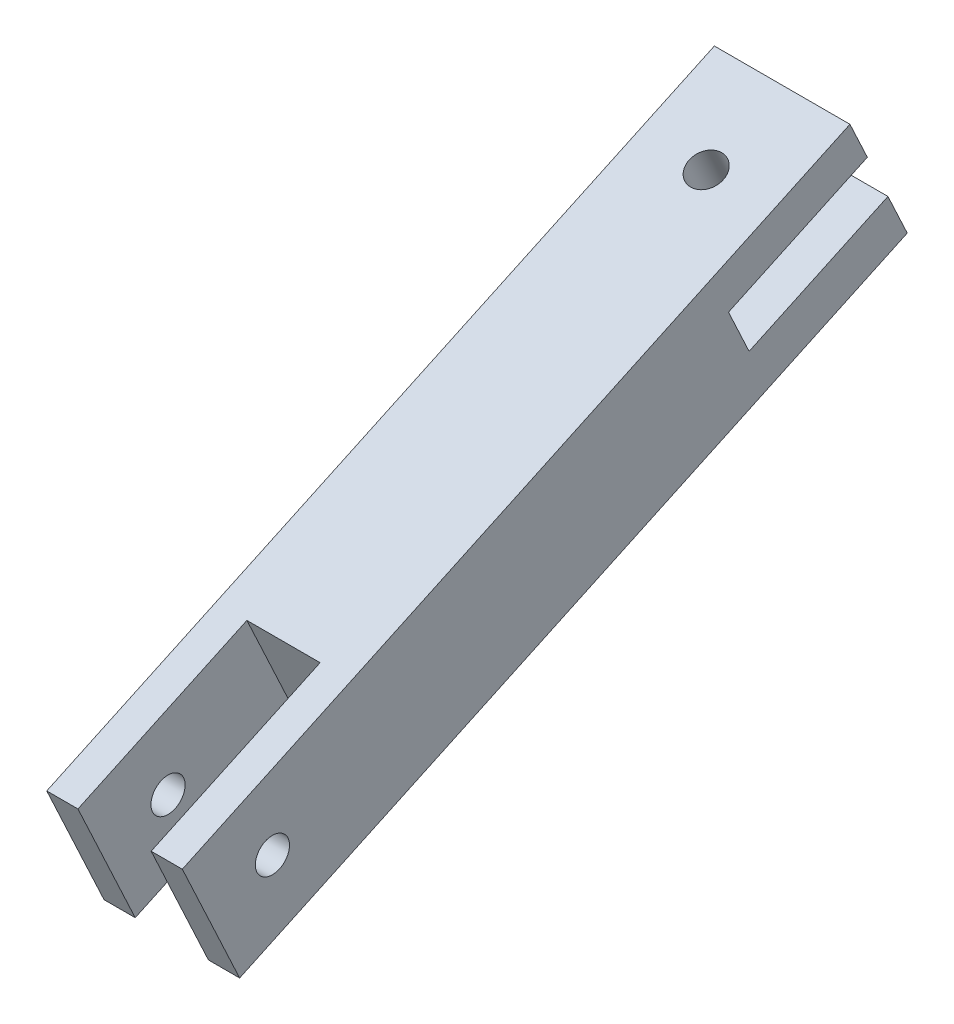
ISO-10303-21;
HEADER;
FILE_DESCRIPTION(('STEP AP214'),'2;1');
FILE_NAME('part.step','',(''),(''),'','','');
FILE_SCHEMA(('AUTOMOTIVE_DESIGN { 1 0 10303 214 1 1 1 1 }'));
ENDSEC;
DATA;
#1=APPLICATION_CONTEXT('core data for automotive mechanical design processes');
#2=APPLICATION_PROTOCOL_DEFINITION('international standard','automotive_design',2000,#1);
#3=PRODUCT_CONTEXT('',#1,'mechanical');
#4=PRODUCT('Part','Part','',(#3));
#5=PRODUCT_RELATED_PRODUCT_CATEGORY('part','',(#4));
#6=PRODUCT_DEFINITION_FORMATION('','',#4);
#7=PRODUCT_DEFINITION_CONTEXT('part definition',#1,'design');
#8=PRODUCT_DEFINITION('design','',#6,#7);
#9=PRODUCT_DEFINITION_SHAPE('','',#8);
#10=(LENGTH_UNIT() NAMED_UNIT(*) SI_UNIT(.MILLI.,.METRE.));
#11=(NAMED_UNIT(*) PLANE_ANGLE_UNIT() SI_UNIT($,.RADIAN.));
#12=(NAMED_UNIT(*) SI_UNIT($,.STERADIAN.) SOLID_ANGLE_UNIT());
#13=UNCERTAINTY_MEASURE_WITH_UNIT(LENGTH_MEASURE(1.E-05),#10,'distance_accuracy_value','');
#14=(GEOMETRIC_REPRESENTATION_CONTEXT(3) GLOBAL_UNCERTAINTY_ASSIGNED_CONTEXT((#13)) GLOBAL_UNIT_ASSIGNED_CONTEXT((#10,
#11,#12)) REPRESENTATION_CONTEXT('',''));
#15=CARTESIAN_POINT('',(0.,0.,0.));
#16=DIRECTION('',(0.,0.,1.));
#17=DIRECTION('',(1.,0.,0.));
#18=AXIS2_PLACEMENT_3D('',#15,#16,#17);
#19=CARTESIAN_POINT('',(6.34999999999999,-18.3975792107983,117.979115991198));
#20=DIRECTION('',(-1.,0.,0.));
#21=DIRECTION('',(0.,0.,1.));
#22=AXIS2_PLACEMENT_3D('',#19,#20,#21);
#23=PLANE('',#22);
#24=CARTESIAN_POINT('',(6.35000000000003,-21.4690076964276,109.540435581462));
#25=DIRECTION('',(-1.,0.,0.));
#26=DIRECTION('',(0.,0.,1.));
#27=AXIS2_PLACEMENT_3D('',#24,#25,#26);
#28=CIRCLE('',#27,1.6);
#29=CARTESIAN_POINT('',(6.35000000000003,-21.4690076964276,111.140435581462));
#30=VERTEX_POINT('',#29);
#31=EDGE_CURVE('E306',#30,#30,#28,.T.);
#32=ORIENTED_EDGE('',*,*,#31,.T.);
#33=EDGE_LOOP('',(#32));
#34=FACE_BOUND('',#33,.T.);
#35=DIRECTION('',(0.,-0.4226182617407,0.90630778703665));
#36=VECTOR('',#35,1.);
#37=CARTESIAN_POINT('',(6.34999999999999,26.5871004996355,12.3977685711166));
#38=LINE('',#37,#36);
#39=CARTESIAN_POINT('',(6.35,7.27294535654771,53.8171079392636));
#40=VERTEX_POINT('',#39);
#41=CARTESIAN_POINT('',(6.35000000000001,1.20891425194369,66.8214646092722));
#42=VERTEX_POINT('',#41);
#43=EDGE_CURVE('E147',#40,#42,#38,.T.);
#44=ORIENTED_EDGE('',*,*,#43,.F.);
#45=DIRECTION('',(0.,-0.90630778703665,-0.4226182617407));
#46=VECTOR('',#45,1.);
#47=CARTESIAN_POINT('',(6.35,10.7628103736225,55.4444587226528));
#48=LINE('',#47,#46);
#49=CARTESIAN_POINT('',(6.35,10.7628103736225,55.4444587226528));
#50=VERTEX_POINT('',#49);
#51=EDGE_CURVE('E143',#50,#40,#48,.T.);
#52=ORIENTED_EDGE('',*,*,#51,.F.);
#53=DIRECTION('',(0.,0.4226182617407,-0.906307787036649));
#54=VECTOR('',#53,1.);
#55=CARTESIAN_POINT('',(6.34999999999999,-18.3975792107983,117.979115991198));
#56=LINE('',#55,#54);
#57=CARTESIAN_POINT('',(6.34999999999999,-18.3975792107983,117.979115991198));
#58=VERTEX_POINT('',#57);
#59=EDGE_CURVE('E128',#58,#50,#56,.T.);
#60=ORIENTED_EDGE('',*,*,#59,.F.);
#61=DIRECTION('',(0.,-0.90630778703665,-0.4226182617407));
#62=VECTOR('',#61,1.);
#63=CARTESIAN_POINT('',(6.34999999999999,-18.3975792107983,117.979115991198));
#64=LINE('',#63,#62);
#65=CARTESIAN_POINT('',(6.34999999999999,-29.9076881061637,112.611864067091));
#66=VERTEX_POINT('',#65);
#67=EDGE_CURVE('E151',#58,#66,#64,.T.);
#68=ORIENTED_EDGE('',*,*,#67,.T.);
#69=DIRECTION('',(0.,0.4226182617407,-0.906307787036649));
#70=VECTOR('',#69,1.);
#71=CARTESIAN_POINT('',(6.34999999999999,-29.9076881061637,112.611864067091));
#72=LINE('',#71,#70);
#73=CARTESIAN_POINT('',(6.35,-0.747298521742937,50.077206798546));
#74=VERTEX_POINT('',#73);
#75=EDGE_CURVE('E181',#66,#74,#72,.T.);
#76=ORIENTED_EDGE('',*,*,#75,.T.);
#77=CARTESIAN_POINT('',(6.35,3.12930615421613,51.8848972465851));
#78=VERTEX_POINT('',#77);
#79=EDGE_CURVE('E152',#78,#74,#48,.T.);
#80=ORIENTED_EDGE('',*,*,#79,.F.);
#81=DIRECTION('',(0.,0.422618261740699,-0.90630778703665));
#82=VECTOR('',#81,1.);
#83=CARTESIAN_POINT('',(6.34999999999999,22.4434612973039,10.4655578784381));
#84=LINE('',#83,#82);
#85=CARTESIAN_POINT('',(6.35000000000001,-2.93472495038789,64.8892539165937));
#86=VERTEX_POINT('',#85);
#87=EDGE_CURVE('E294',#86,#78,#84,.T.);
#88=ORIENTED_EDGE('',*,*,#87,.F.);
#89=DIRECTION('',(0.,-0.90630778703665,-0.4226182617407));
#90=VECTOR('',#89,1.);
#91=CARTESIAN_POINT('',(6.35,-25.3781862476918,54.4236960381555));
#92=LINE('',#91,#90);
#93=EDGE_CURVE('E238',#42,#86,#92,.T.);
#94=ORIENTED_EDGE('',*,*,#93,.F.);
#95=EDGE_LOOP('',(#44,#52,#60,#68,#76,#80,#88,#94));
#96=FACE_BOUND('',#95,.T.);
#97=ADVANCED_FACE('F45',(#34,#96),#23,.F.);
#98=CARTESIAN_POINT('',(6.35,10.7628103736225,55.4444587226528));
#99=DIRECTION('',(0.,-0.4226182617407,0.90630778703665));
#100=DIRECTION('',(0.,-0.90630778703665,-0.4226182617407));
#101=AXIS2_PLACEMENT_3D('',#98,#99,#100);
#102=PLANE('',#101);
#103=DIRECTION('',(-1.,0.,0.));
#104=VECTOR('',#103,1.);
#105=CARTESIAN_POINT('',(6.35,7.27294535654771,53.8171079392636));
#106=LINE('',#105,#104);
#107=CARTESIAN_POINT('',(-6.34999999999999,7.27294535654771,53.8171079392636));
#108=VERTEX_POINT('',#107);
#109=EDGE_CURVE('E235',#40,#108,#106,.T.);
#110=ORIENTED_EDGE('',*,*,#109,.T.);
#111=DIRECTION('',(0.,-0.90630778703665,-0.4226182617407));
#112=VECTOR('',#111,1.);
#113=CARTESIAN_POINT('',(-6.34999999999999,10.7628103736225,55.4444587226528));
#114=LINE('',#113,#112);
#115=CARTESIAN_POINT('',(-6.34999999999999,10.7628103736225,55.4444587226528));
#116=VERTEX_POINT('',#115);
#117=EDGE_CURVE('E156',#116,#108,#114,.T.);
#118=ORIENTED_EDGE('',*,*,#117,.F.);
#119=DIRECTION('',(-1.,0.,0.));
#120=VECTOR('',#119,1.);
#121=CARTESIAN_POINT('',(6.35,10.7628103736225,55.4444587226528));
#122=LINE('',#121,#120);
#123=EDGE_CURVE('E132',#50,#116,#122,.T.);
#124=ORIENTED_EDGE('',*,*,#123,.F.);
#125=ORIENTED_EDGE('',*,*,#51,.T.);
#126=EDGE_LOOP('',(#110,#118,#124,#125));
#127=FACE_BOUND('',#126,.T.);
#128=ADVANCED_FACE('F154',(#127),#102,.F.);
#129=DIRECTION('',(-1.,0.,0.));
#130=VECTOR('',#129,1.);
#131=CARTESIAN_POINT('',(6.35,3.12930615421613,51.8848972465851));
#132=LINE('',#131,#130);
#133=CARTESIAN_POINT('',(-6.34999999999999,3.12930615421613,51.8848972465852));
#134=VERTEX_POINT('',#133);
#135=EDGE_CURVE('E63',#78,#134,#132,.T.);
#136=ORIENTED_EDGE('',*,*,#135,.F.);
#137=ORIENTED_EDGE('',*,*,#79,.T.);
#138=DIRECTION('',(-1.,0.,0.));
#139=VECTOR('',#138,1.);
#140=CARTESIAN_POINT('',(6.35,-0.747298521742937,50.077206798546));
#141=LINE('',#140,#139);
#142=CARTESIAN_POINT('',(-6.34999999999999,-0.747298521742937,50.077206798546));
#143=VERTEX_POINT('',#142);
#144=EDGE_CURVE('E185',#74,#143,#141,.T.);
#145=ORIENTED_EDGE('',*,*,#144,.T.);
#146=EDGE_CURVE('E194',#134,#143,#114,.T.);
#147=ORIENTED_EDGE('',*,*,#146,.F.);
#148=EDGE_LOOP('',(#136,#137,#145,#147));
#149=FACE_BOUND('',#148,.T.);
#150=ADVANCED_FACE('F273',(#149),#102,.F.);
#151=CARTESIAN_POINT('',(-6.34999999999999,10.7628103736225,55.4444587226528));
#152=DIRECTION('',(1.,0.,0.));
#153=DIRECTION('',(0.,0.,-1.));
#154=AXIS2_PLACEMENT_3D('',#151,#152,#153);
#155=PLANE('',#154);
#156=CARTESIAN_POINT('',(-6.34999999999997,-21.4690076964276,109.540435581462));
#157=DIRECTION('',(-1.,0.,0.));
#158=DIRECTION('',(0.,0.,1.));
#159=AXIS2_PLACEMENT_3D('',#156,#157,#158);
#160=CIRCLE('',#159,1.6);
#161=CARTESIAN_POINT('',(-6.34999999999997,-21.4690076964276,111.140435581462));
#162=VERTEX_POINT('',#161);
#163=EDGE_CURVE('E310',#162,#162,#160,.T.);
#164=ORIENTED_EDGE('',*,*,#163,.F.);
#165=EDGE_LOOP('',(#164));
#166=FACE_BOUND('',#165,.T.);
#167=DIRECTION('',(0.,-0.4226182617407,0.90630778703665));
#168=VECTOR('',#167,1.);
#169=CARTESIAN_POINT('',(-6.35000000000001,26.5871004996355,12.3977685711166));
#170=LINE('',#169,#168);
#171=CARTESIAN_POINT('',(-6.34999999999998,1.20891425194369,66.8214646092722));
#172=VERTEX_POINT('',#171);
#173=EDGE_CURVE('E285',#108,#172,#170,.T.);
#174=ORIENTED_EDGE('',*,*,#173,.T.);
#175=DIRECTION('',(0.,-0.90630778703665,-0.4226182617407));
#176=VECTOR('',#175,1.);
#177=CARTESIAN_POINT('',(-6.34999999999999,-25.3781862476918,54.4236960381555));
#178=LINE('',#177,#176);
#179=CARTESIAN_POINT('',(-6.34999999999998,-2.93472495038789,64.8892539165937));
#180=VERTEX_POINT('',#179);
#181=EDGE_CURVE('E230',#172,#180,#178,.T.);
#182=ORIENTED_EDGE('',*,*,#181,.T.);
#183=DIRECTION('',(0.,0.422618261740699,-0.90630778703665));
#184=VECTOR('',#183,1.);
#185=CARTESIAN_POINT('',(-6.35000000000001,22.4434612973039,10.4655578784381));
#186=LINE('',#185,#184);
#187=EDGE_CURVE('E280',#180,#134,#186,.T.);
#188=ORIENTED_EDGE('',*,*,#187,.T.);
#189=ORIENTED_EDGE('',*,*,#146,.T.);
#190=DIRECTION('',(0.,-0.4226182617407,0.906307787036649));
#191=VECTOR('',#190,1.);
#192=CARTESIAN_POINT('',(-6.34999999999999,-0.747298521742937,50.077206798546));
#193=LINE('',#192,#191);
#194=CARTESIAN_POINT('',(-6.34999999999997,-29.9076881061637,112.611864067091));
#195=VERTEX_POINT('',#194);
#196=EDGE_CURVE('E104',#143,#195,#193,.T.);
#197=ORIENTED_EDGE('',*,*,#196,.T.);
#198=DIRECTION('',(0.,-0.90630778703665,-0.4226182617407));
#199=VECTOR('',#198,1.);
#200=CARTESIAN_POINT('',(-6.34999999999997,-18.3975792107983,117.979115991198));
#201=LINE('',#200,#199);
#202=CARTESIAN_POINT('',(-6.34999999999997,-18.3975792107983,117.979115991198));
#203=VERTEX_POINT('',#202);
#204=EDGE_CURVE('E160',#203,#195,#201,.T.);
#205=ORIENTED_EDGE('',*,*,#204,.F.);
#206=DIRECTION('',(0.,-0.4226182617407,0.906307787036649));
#207=VECTOR('',#206,1.);
#208=CARTESIAN_POINT('',(-6.34999999999999,10.7628103736225,55.4444587226528));
#209=LINE('',#208,#207);
#210=EDGE_CURVE('E72',#116,#203,#209,.T.);
#211=ORIENTED_EDGE('',*,*,#210,.F.);
#212=ORIENTED_EDGE('',*,*,#117,.T.);
#213=EDGE_LOOP('',(#174,#182,#188,#189,#197,#205,#211,#212));
#214=FACE_BOUND('',#213,.T.);
#215=ADVANCED_FACE('F278',(#166,#214),#155,.F.);
#216=CARTESIAN_POINT('',(0.,7.44525701895805,62.5589748508905));
#217=DIRECTION('',(0.,0.906307787036649,0.422618261740701));
#218=DIRECTION('',(0.,-0.422618261740701,0.906307787036649));
#219=AXIS2_PLACEMENT_3D('',#216,#217,#218);
#220=CYLINDRICAL_SURFACE('',#219,1.59999999999999);
#221=CARTESIAN_POINT('',(0.,7.44525701895805,62.5589748508905));
#222=DIRECTION('',(0.,0.906307787036649,0.422618261740701));
#223=DIRECTION('',(0.,-0.422618261740701,0.906307787036649));
#224=AXIS2_PLACEMENT_3D('',#221,#222,#223);
#225=CIRCLE('',#224,1.6);
#226=CARTESIAN_POINT('',(0.,6.76906780017293,64.0090673101492));
#227=VERTEX_POINT('',#226);
#228=EDGE_CURVE('E218',#227,#227,#225,.T.);
#229=ORIENTED_EDGE('',*,*,#228,.T.);
#230=EDGE_LOOP('',(#229));
#231=FACE_BOUND('',#230,.T.);
#232=CARTESIAN_POINT('',(0.,3.95539200188322,60.9316240675013));
#233=DIRECTION('',(0.,-0.90630778703665,-0.4226182617407));
#234=DIRECTION('',(0.,0.4226182617407,-0.90630778703665));
#235=AXIS2_PLACEMENT_3D('',#232,#233,#234);
#236=CIRCLE('',#235,1.59999999999999);
#237=CARTESIAN_POINT('',(0.,4.63158122066834,59.4815316082427));
#238=VERTEX_POINT('',#237);
#239=EDGE_CURVE('E49',#238,#238,#236,.F.);
#240=ORIENTED_EDGE('',*,*,#239,.F.);
#241=EDGE_LOOP('',(#240));
#242=FACE_BOUND('',#241,.T.);
#243=ADVANCED_FACE('F319',(#231,#242),#220,.F.);
#244=CARTESIAN_POINT('',(0.,-4.0648518764074,57.1917229267836));
#245=DIRECTION('',(0.,0.906307787036649,0.422618261740701));
#246=DIRECTION('',(0.,-0.422618261740701,0.906307787036649));
#247=AXIS2_PLACEMENT_3D('',#244,#245,#246);
#248=CIRCLE('',#247,1.59999999999999);
#249=CARTESIAN_POINT('',(0.,-4.74104109519252,58.6418153860423));
#250=VERTEX_POINT('',#249);
#251=EDGE_CURVE('E169',#250,#250,#248,.T.);
#252=ORIENTED_EDGE('',*,*,#251,.F.);
#253=EDGE_LOOP('',(#252));
#254=FACE_BOUND('',#253,.T.);
#255=CARTESIAN_POINT('',(0.,-0.188247200448352,58.9994133748228));
#256=DIRECTION('',(0.,0.90630778703665,0.422618261740699));
#257=DIRECTION('',(0.,-0.422618261740699,0.90630778703665));
#258=AXIS2_PLACEMENT_3D('',#255,#256,#257);
#259=CIRCLE('',#258,1.59999999999999);
#260=CARTESIAN_POINT('',(0.,-0.864436419233469,60.4495058340815));
#261=VERTEX_POINT('',#260);
#262=EDGE_CURVE('E209',#261,#261,#259,.F.);
#263=ORIENTED_EDGE('',*,*,#262,.F.);
#264=EDGE_LOOP('',(#263));
#265=FACE_BOUND('',#264,.T.);
#266=ADVANCED_FACE('F325',(#254,#265),#220,.F.);
#267=CARTESIAN_POINT('',(-6.34999999999997,-18.3975792107983,117.979115991198));
#268=DIRECTION('',(0.,0.4226182617407,-0.90630778703665));
#269=DIRECTION('',(0.,0.90630778703665,0.4226182617407));
#270=AXIS2_PLACEMENT_3D('',#267,#268,#269);
#271=PLANE('',#270);
#272=DIRECTION('',(1.,0.,0.));
#273=VECTOR('',#272,1.);
#274=CARTESIAN_POINT('',(-6.34999999999997,-29.9076881061637,112.611864067091));
#275=LINE('',#274,#273);
#276=CARTESIAN_POINT('',(-3.42899999999999,-29.9076881061637,112.611864067091));
#277=VERTEX_POINT('',#276);
#278=EDGE_CURVE('E164',#195,#277,#275,.T.);
#279=ORIENTED_EDGE('',*,*,#278,.T.);
#280=DIRECTION('',(0.,-0.90630778703665,-0.4226182617407));
#281=VECTOR('',#280,1.);
#282=CARTESIAN_POINT('',(-3.42899999999999,-18.3975792107983,117.979115991198));
#283=LINE('',#282,#281);
#284=CARTESIAN_POINT('',(-3.42899999999999,-18.3975792107983,117.979115991198));
#285=VERTEX_POINT('',#284);
#286=EDGE_CURVE('E11',#285,#277,#283,.T.);
#287=ORIENTED_EDGE('',*,*,#286,.F.);
#288=DIRECTION('',(1.,0.,0.));
#289=VECTOR('',#288,1.);
#290=CARTESIAN_POINT('',(-6.34999999999997,-18.3975792107983,117.979115991198));
#291=LINE('',#290,#289);
#292=EDGE_CURVE('E191',#203,#285,#291,.T.);
#293=ORIENTED_EDGE('',*,*,#292,.F.);
#294=ORIENTED_EDGE('',*,*,#204,.T.);
#295=EDGE_LOOP('',(#279,#287,#293,#294));
#296=FACE_BOUND('',#295,.T.);
#297=ADVANCED_FACE('F47',(#296),#271,.F.);
#298=CARTESIAN_POINT('',(-3.42899999999999,-18.3975792107983,117.979115991198));
#299=DIRECTION('',(-1.,0.,0.));
#300=DIRECTION('',(0.,0.,1.));
#301=AXIS2_PLACEMENT_3D('',#298,#299,#300);
#302=PLANE('',#301);
#303=CARTESIAN_POINT('',(-3.42899999999999,-21.4690076964276,109.540435581462));
#304=DIRECTION('',(-1.,0.,0.));
#305=DIRECTION('',(0.,0.,1.));
#306=AXIS2_PLACEMENT_3D('',#303,#304,#305);
#307=CIRCLE('',#306,1.6);
#308=CARTESIAN_POINT('',(-3.42899999999999,-21.4690076964276,111.140435581462));
#309=VERTEX_POINT('',#308);
#310=EDGE_CURVE('E288',#309,#309,#307,.T.);
#311=ORIENTED_EDGE('',*,*,#310,.T.);
#312=EDGE_LOOP('',(#311));
#313=FACE_BOUND('',#312,.T.);
#314=DIRECTION('',(0.,0.422618261740701,-0.906307787036649));
#315=VECTOR('',#314,1.);
#316=CARTESIAN_POINT('',(-3.42899999999999,-29.9076881061637,112.611864067091));
#317=LINE('',#316,#315);
#318=CARTESIAN_POINT('',(-3.42899999999999,-22.5277167105168,96.7854643359637));
#319=VERTEX_POINT('',#318);
#320=EDGE_CURVE('E168',#277,#319,#317,.T.);
#321=ORIENTED_EDGE('',*,*,#320,.T.);
#322=DIRECTION('',(0.,-0.90630778703665,-0.4226182617407));
#323=VECTOR('',#322,1.);
#324=CARTESIAN_POINT('',(-3.42899999999999,-11.0176078151513,102.152716260071));
#325=LINE('',#324,#323);
#326=CARTESIAN_POINT('',(-3.42899999999999,-11.0176078151513,102.152716260071));
#327=VERTEX_POINT('',#326);
#328=EDGE_CURVE('E55',#327,#319,#325,.T.);
#329=ORIENTED_EDGE('',*,*,#328,.F.);
#330=DIRECTION('',(0.,0.422618261740701,-0.906307787036649));
#331=VECTOR('',#330,1.);
#332=CARTESIAN_POINT('',(-3.42899999999999,-18.3975792107983,117.979115991198));
#333=LINE('',#332,#331);
#334=EDGE_CURVE('E112',#285,#327,#333,.T.);
#335=ORIENTED_EDGE('',*,*,#334,.F.);
#336=ORIENTED_EDGE('',*,*,#286,.T.);
#337=EDGE_LOOP('',(#321,#329,#335,#336));
#338=FACE_BOUND('',#337,.T.);
#339=ADVANCED_FACE('F344',(#313,#338),#302,.F.);
#340=CARTESIAN_POINT('',(-3.42899999999999,-11.0176078151513,102.152716260071));
#341=DIRECTION('',(0.,0.4226182617407,-0.90630778703665));
#342=DIRECTION('',(0.,0.90630778703665,0.4226182617407));
#343=AXIS2_PLACEMENT_3D('',#340,#341,#342);
#344=PLANE('',#343);
#345=DIRECTION('',(1.,0.,0.));
#346=VECTOR('',#345,1.);
#347=CARTESIAN_POINT('',(-3.42899999999999,-22.5277167105168,96.7854643359637));
#348=LINE('',#347,#346);
#349=CARTESIAN_POINT('',(3.42900000000001,-22.5277167105168,96.7854643359637));
#350=VERTEX_POINT('',#349);
#351=EDGE_CURVE('E172',#319,#350,#348,.T.);
#352=ORIENTED_EDGE('',*,*,#351,.T.);
#353=DIRECTION('',(0.,-0.90630778703665,-0.4226182617407));
#354=VECTOR('',#353,1.);
#355=CARTESIAN_POINT('',(3.42900000000001,-11.0176078151513,102.152716260071));
#356=LINE('',#355,#354);
#357=CARTESIAN_POINT('',(3.42900000000001,-11.0176078151513,102.152716260071));
#358=VERTEX_POINT('',#357);
#359=EDGE_CURVE('E203',#358,#350,#356,.T.);
#360=ORIENTED_EDGE('',*,*,#359,.F.);
#361=DIRECTION('',(1.,0.,0.));
#362=VECTOR('',#361,1.);
#363=CARTESIAN_POINT('',(-3.42899999999999,-11.0176078151513,102.152716260071));
#364=LINE('',#363,#362);
#365=EDGE_CURVE('E249',#327,#358,#364,.T.);
#366=ORIENTED_EDGE('',*,*,#365,.F.);
#367=ORIENTED_EDGE('',*,*,#328,.T.);
#368=EDGE_LOOP('',(#352,#360,#366,#367));
#369=FACE_BOUND('',#368,.T.);
#370=ADVANCED_FACE('F341',(#369),#344,.F.);
#371=CARTESIAN_POINT('',(3.42900000000001,-11.0176078151513,102.152716260071));
#372=DIRECTION('',(1.,0.,0.));
#373=DIRECTION('',(0.,0.,-1.));
#374=AXIS2_PLACEMENT_3D('',#371,#372,#373);
#375=PLANE('',#374);
#376=CARTESIAN_POINT('',(3.42900000000001,-21.4690076964276,109.540435581462));
#377=DIRECTION('',(1.,0.,0.));
#378=DIRECTION('',(0.,0.,-1.));
#379=AXIS2_PLACEMENT_3D('',#376,#377,#378);
#380=CIRCLE('',#379,1.6);
#381=CARTESIAN_POINT('',(3.42900000000001,-21.4690076964276,107.940435581462));
#382=VERTEX_POINT('',#381);
#383=EDGE_CURVE('E302',#382,#382,#380,.T.);
#384=ORIENTED_EDGE('',*,*,#383,.T.);
#385=EDGE_LOOP('',(#384));
#386=FACE_BOUND('',#385,.T.);
#387=DIRECTION('',(0.,-0.422618261740701,0.906307787036649));
#388=VECTOR('',#387,1.);
#389=CARTESIAN_POINT('',(3.42900000000001,-22.5277167105168,96.7854643359637));
#390=LINE('',#389,#388);
#391=CARTESIAN_POINT('',(3.42900000000001,-29.9076881061637,112.611864067091));
#392=VERTEX_POINT('',#391);
#393=EDGE_CURVE('E175',#350,#392,#390,.T.);
#394=ORIENTED_EDGE('',*,*,#393,.T.);
#395=DIRECTION('',(0.,-0.90630778703665,-0.4226182617407));
#396=VECTOR('',#395,1.);
#397=CARTESIAN_POINT('',(3.42900000000001,-18.3975792107983,117.979115991198));
#398=LINE('',#397,#396);
#399=CARTESIAN_POINT('',(3.42900000000001,-18.3975792107983,117.979115991198));
#400=VERTEX_POINT('',#399);
#401=EDGE_CURVE('E199',#400,#392,#398,.T.);
#402=ORIENTED_EDGE('',*,*,#401,.F.);
#403=DIRECTION('',(0.,-0.422618261740701,0.906307787036649));
#404=VECTOR('',#403,1.);
#405=CARTESIAN_POINT('',(3.42900000000001,-11.0176078151513,102.152716260071));
#406=LINE('',#405,#404);
#407=EDGE_CURVE('E252',#358,#400,#406,.T.);
#408=ORIENTED_EDGE('',*,*,#407,.F.);
#409=ORIENTED_EDGE('',*,*,#359,.T.);
#410=EDGE_LOOP('',(#394,#402,#408,#409));
#411=FACE_BOUND('',#410,.T.);
#412=ADVANCED_FACE('F260',(#386,#411),#375,.F.);
#413=CARTESIAN_POINT('',(3.42900000000001,-18.3975792107983,117.979115991198));
#414=DIRECTION('',(0.,0.4226182617407,-0.90630778703665));
#415=DIRECTION('',(0.,0.90630778703665,0.4226182617407));
#416=AXIS2_PLACEMENT_3D('',#413,#414,#415);
#417=PLANE('',#416);
#418=DIRECTION('',(1.,0.,0.));
#419=VECTOR('',#418,1.);
#420=CARTESIAN_POINT('',(3.42900000000001,-29.9076881061637,112.611864067091));
#421=LINE('',#420,#419);
#422=EDGE_CURVE('E178',#392,#66,#421,.T.);
#423=ORIENTED_EDGE('',*,*,#422,.T.);
#424=ORIENTED_EDGE('',*,*,#67,.F.);
#425=DIRECTION('',(1.,0.,0.));
#426=VECTOR('',#425,1.);
#427=CARTESIAN_POINT('',(3.42900000000001,-18.3975792107983,117.979115991198));
#428=LINE('',#427,#426);
#429=EDGE_CURVE('E135',#400,#58,#428,.T.);
#430=ORIENTED_EDGE('',*,*,#429,.F.);
#431=ORIENTED_EDGE('',*,*,#401,.T.);
#432=EDGE_LOOP('',(#423,#424,#430,#431));
#433=FACE_BOUND('',#432,.T.);
#434=ADVANCED_FACE('F264',(#433),#417,.F.);
#435=CARTESIAN_POINT('',(0.,30.0769655167104,14.0251193545059));
#436=DIRECTION('',(0.,0.906307787036649,0.422618261740701));
#437=DIRECTION('',(0.,-0.422618261740701,0.906307787036649));
#438=AXIS2_PLACEMENT_3D('',#435,#436,#437);
#439=PLANE('',#438);
#440=ORIENTED_EDGE('',*,*,#228,.F.);
#441=EDGE_LOOP('',(#440));
#442=FACE_BOUND('',#441,.T.);
#443=ORIENTED_EDGE('',*,*,#292,.T.);
#444=ORIENTED_EDGE('',*,*,#334,.T.);
#445=ORIENTED_EDGE('',*,*,#365,.T.);
#446=ORIENTED_EDGE('',*,*,#407,.T.);
#447=ORIENTED_EDGE('',*,*,#429,.T.);
#448=ORIENTED_EDGE('',*,*,#59,.T.);
#449=ORIENTED_EDGE('',*,*,#123,.T.);
#450=ORIENTED_EDGE('',*,*,#210,.T.);
#451=EDGE_LOOP('',(#443,#444,#445,#446,#447,#448,#449,#450));
#452=FACE_BOUND('',#451,.T.);
#453=ADVANCED_FACE('F130',(#442,#452),#439,.T.);
#454=CARTESIAN_POINT('',(0.,18.5668566213449,8.65786743039901));
#455=DIRECTION('',(0.,0.906307787036649,0.422618261740701));
#456=DIRECTION('',(0.,-0.422618261740701,0.906307787036649));
#457=AXIS2_PLACEMENT_3D('',#454,#455,#456);
#458=PLANE('',#457);
#459=ORIENTED_EDGE('',*,*,#251,.T.);
#460=EDGE_LOOP('',(#459));
#461=FACE_BOUND('',#460,.T.);
#462=ORIENTED_EDGE('',*,*,#278,.F.);
#463=ORIENTED_EDGE('',*,*,#196,.F.);
#464=ORIENTED_EDGE('',*,*,#144,.F.);
#465=ORIENTED_EDGE('',*,*,#75,.F.);
#466=ORIENTED_EDGE('',*,*,#422,.F.);
#467=ORIENTED_EDGE('',*,*,#393,.F.);
#468=ORIENTED_EDGE('',*,*,#351,.F.);
#469=ORIENTED_EDGE('',*,*,#320,.F.);
#470=EDGE_LOOP('',(#462,#463,#464,#465,#466,#467,#468,#469));
#471=FACE_BOUND('',#470,.T.);
#472=ADVANCED_FACE('F270',(#461,#471),#458,.F.);
#473=CARTESIAN_POINT('',(6.34999999999999,26.5871004996355,12.3977685711166));
#474=DIRECTION('',(0.,-0.90630778703665,-0.4226182617407));
#475=DIRECTION('',(0.,0.4226182617407,-0.90630778703665));
#476=AXIS2_PLACEMENT_3D('',#473,#474,#475);
#477=PLANE('',#476);
#478=ORIENTED_EDGE('',*,*,#173,.F.);
#479=ORIENTED_EDGE('',*,*,#109,.F.);
#480=ORIENTED_EDGE('',*,*,#43,.T.);
#481=DIRECTION('',(-1.,0.,0.));
#482=VECTOR('',#481,1.);
#483=CARTESIAN_POINT('',(6.35000000000001,1.20891425194369,66.8214646092722));
#484=LINE('',#483,#482);
#485=EDGE_CURVE('E212',#42,#172,#484,.T.);
#486=ORIENTED_EDGE('',*,*,#485,.T.);
#487=EDGE_LOOP('',(#478,#479,#480,#486));
#488=FACE_BOUND('',#487,.T.);
#489=ORIENTED_EDGE('',*,*,#239,.T.);
#490=EDGE_LOOP('',(#489));
#491=FACE_BOUND('',#490,.T.);
#492=ADVANCED_FACE('F368',(#488,#491),#477,.T.);
#493=CARTESIAN_POINT('',(6.34999999999999,22.4434612973039,10.4655578784381));
#494=DIRECTION('',(0.,0.90630778703665,0.422618261740699));
#495=DIRECTION('',(0.,-0.422618261740699,0.90630778703665));
#496=AXIS2_PLACEMENT_3D('',#493,#494,#495);
#497=PLANE('',#496);
#498=ORIENTED_EDGE('',*,*,#187,.F.);
#499=DIRECTION('',(-1.,0.,0.));
#500=VECTOR('',#499,1.);
#501=CARTESIAN_POINT('',(6.35000000000001,-2.93472495038789,64.8892539165937));
#502=LINE('',#501,#500);
#503=EDGE_CURVE('E220',#86,#180,#502,.T.);
#504=ORIENTED_EDGE('',*,*,#503,.F.);
#505=ORIENTED_EDGE('',*,*,#87,.T.);
#506=ORIENTED_EDGE('',*,*,#135,.T.);
#507=EDGE_LOOP('',(#498,#504,#505,#506));
#508=FACE_BOUND('',#507,.T.);
#509=ORIENTED_EDGE('',*,*,#262,.T.);
#510=EDGE_LOOP('',(#509));
#511=FACE_BOUND('',#510,.T.);
#512=ADVANCED_FACE('F366',(#508,#511),#497,.T.);
#513=CARTESIAN_POINT('',(6.35,-25.3781862476918,54.4236960381555));
#514=DIRECTION('',(0.,0.4226182617407,-0.906307787036649));
#515=DIRECTION('',(0.,0.90630778703665,0.4226182617407));
#516=AXIS2_PLACEMENT_3D('',#513,#514,#515);
#517=PLANE('',#516);
#518=ORIENTED_EDGE('',*,*,#181,.F.);
#519=ORIENTED_EDGE('',*,*,#485,.F.);
#520=ORIENTED_EDGE('',*,*,#93,.T.);
#521=ORIENTED_EDGE('',*,*,#503,.T.);
#522=EDGE_LOOP('',(#518,#519,#520,#521));
#523=FACE_BOUND('',#522,.T.);
#524=ADVANCED_FACE('F365',(#523),#517,.T.);
#525=CARTESIAN_POINT('',(-6.34999999999997,-21.4690076964276,109.540435581462));
#526=DIRECTION('',(-1.,0.,0.));
#527=DIRECTION('',(0.,0.,1.));
#528=AXIS2_PLACEMENT_3D('',#525,#526,#527);
#529=CYLINDRICAL_SURFACE('',#528,1.6);
#530=ORIENTED_EDGE('',*,*,#163,.T.);
#531=EDGE_LOOP('',(#530));
#532=FACE_BOUND('',#531,.T.);
#533=ORIENTED_EDGE('',*,*,#310,.F.);
#534=EDGE_LOOP('',(#533));
#535=FACE_BOUND('',#534,.T.);
#536=ADVANCED_FACE('F315',(#532,#535),#529,.F.);
#537=ORIENTED_EDGE('',*,*,#31,.F.);
#538=EDGE_LOOP('',(#537));
#539=FACE_BOUND('',#538,.T.);
#540=ORIENTED_EDGE('',*,*,#383,.F.);
#541=EDGE_LOOP('',(#540));
#542=FACE_BOUND('',#541,.T.);
#543=ADVANCED_FACE('F474',(#539,#542),#529,.F.);
#544=CLOSED_SHELL('',(#97,#128,#150,#215,#243,#266,#297,#339,#370,#412,#434,#453,#472,#492,#512,
#524,#536,#543));
#545=MANIFOLD_SOLID_BREP('B2',#544);
#546=ADVANCED_BREP_SHAPE_REPRESENTATION('',(#18,#545),#14);
#547=SHAPE_DEFINITION_REPRESENTATION(#9,#546);
ENDSEC;
END-ISO-10303-21;
